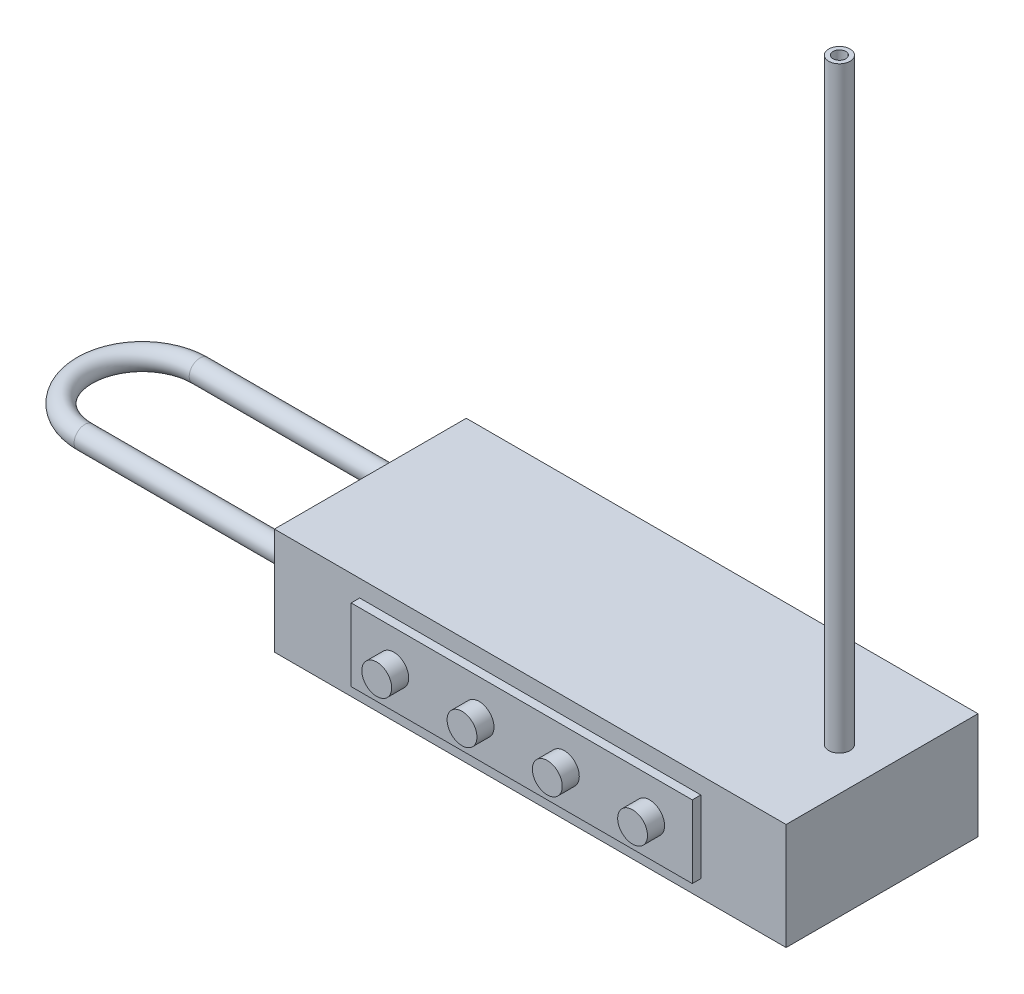
ISO-10303-21;
HEADER;
FILE_DESCRIPTION(('STEP AP214'),'2;1');
FILE_NAME('part.step','',(''),(''),'','','');
FILE_SCHEMA(('AUTOMOTIVE_DESIGN { 1 0 10303 214 1 1 1 1 }'));
ENDSEC;
DATA;
#1=APPLICATION_CONTEXT('core data for automotive mechanical design processes');
#2=APPLICATION_PROTOCOL_DEFINITION('international standard','automotive_design',2000,#1);
#3=PRODUCT_CONTEXT('',#1,'mechanical');
#4=PRODUCT('Part','Part','',(#3));
#5=PRODUCT_RELATED_PRODUCT_CATEGORY('part','',(#4));
#6=PRODUCT_DEFINITION_FORMATION('','',#4);
#7=PRODUCT_DEFINITION_CONTEXT('part definition',#1,'design');
#8=PRODUCT_DEFINITION('design','',#6,#7);
#9=PRODUCT_DEFINITION_SHAPE('','',#8);
#10=(LENGTH_UNIT() NAMED_UNIT(*) SI_UNIT(.MILLI.,.METRE.));
#11=(NAMED_UNIT(*) PLANE_ANGLE_UNIT() SI_UNIT($,.RADIAN.));
#12=(NAMED_UNIT(*) SI_UNIT($,.STERADIAN.) SOLID_ANGLE_UNIT());
#13=UNCERTAINTY_MEASURE_WITH_UNIT(LENGTH_MEASURE(1.E-05),#10,'distance_accuracy_value','');
#14=(GEOMETRIC_REPRESENTATION_CONTEXT(3) GLOBAL_UNCERTAINTY_ASSIGNED_CONTEXT((#13)) GLOBAL_UNIT_ASSIGNED_CONTEXT((#10,
#11,#12)) REPRESENTATION_CONTEXT('',''));
#15=CARTESIAN_POINT('',(0.,0.,0.));
#16=DIRECTION('',(0.,0.,1.));
#17=DIRECTION('',(1.,0.,0.));
#18=AXIS2_PLACEMENT_3D('',#15,#16,#17);
#19=CARTESIAN_POINT('',(-60.,12.5,22.5));
#20=DIRECTION('',(0.,0.,-1.));
#21=DIRECTION('',(-1.,0.,0.));
#22=AXIS2_PLACEMENT_3D('',#19,#20,#21);
#23=PLANE('',#22);
#24=DIRECTION('',(1.,0.,0.));
#25=VECTOR('',#24,1.);
#26=CARTESIAN_POINT('',(-60.,-12.5,22.5));
#27=LINE('',#26,#25);
#28=CARTESIAN_POINT('',(-60.,-12.5,22.5));
#29=VERTEX_POINT('',#28);
#30=CARTESIAN_POINT('',(60.,-12.5,22.5));
#31=VERTEX_POINT('',#30);
#32=EDGE_CURVE('E192',#29,#31,#27,.T.);
#33=ORIENTED_EDGE('',*,*,#32,.T.);
#34=DIRECTION('',(0.,-1.,0.));
#35=VECTOR('',#34,1.);
#36=CARTESIAN_POINT('',(60.,12.5,22.5));
#37=LINE('',#36,#35);
#38=CARTESIAN_POINT('',(60.,12.5,22.5));
#39=VERTEX_POINT('',#38);
#40=EDGE_CURVE('E201',#39,#31,#37,.T.);
#41=ORIENTED_EDGE('',*,*,#40,.F.);
#42=DIRECTION('',(1.,0.,0.));
#43=VECTOR('',#42,1.);
#44=CARTESIAN_POINT('',(-60.,12.5,22.5));
#45=LINE('',#44,#43);
#46=CARTESIAN_POINT('',(-60.,12.5,22.5));
#47=VERTEX_POINT('',#46);
#48=EDGE_CURVE('E198',#47,#39,#45,.T.);
#49=ORIENTED_EDGE('',*,*,#48,.F.);
#50=DIRECTION('',(0.,-1.,0.));
#51=VECTOR('',#50,1.);
#52=CARTESIAN_POINT('',(-60.,12.5,22.5));
#53=LINE('',#52,#51);
#54=EDGE_CURVE('E216',#47,#29,#53,.T.);
#55=ORIENTED_EDGE('',*,*,#54,.T.);
#56=EDGE_LOOP('',(#33,#41,#49,#55));
#57=FACE_BOUND('',#56,.T.);
#58=DIRECTION('',(0.,1.,0.));
#59=VECTOR('',#58,1.);
#60=CARTESIAN_POINT('',(40.,8.5,22.5));
#61=LINE('',#60,#59);
#62=CARTESIAN_POINT('',(40.,-8.5,22.5));
#63=VERTEX_POINT('',#62);
#64=CARTESIAN_POINT('',(40.,8.5,22.5));
#65=VERTEX_POINT('',#64);
#66=EDGE_CURVE('E71',#63,#65,#61,.T.);
#67=ORIENTED_EDGE('',*,*,#66,.F.);
#68=DIRECTION('',(1.,0.,0.));
#69=VECTOR('',#68,1.);
#70=CARTESIAN_POINT('',(-40.,-8.5,22.5));
#71=LINE('',#70,#69);
#72=CARTESIAN_POINT('',(-40.,-8.5,22.5));
#73=VERTEX_POINT('',#72);
#74=EDGE_CURVE('E75',#73,#63,#71,.T.);
#75=ORIENTED_EDGE('',*,*,#74,.F.);
#76=DIRECTION('',(0.,-1.,0.));
#77=VECTOR('',#76,1.);
#78=CARTESIAN_POINT('',(-40.,8.5,22.5));
#79=LINE('',#78,#77);
#80=CARTESIAN_POINT('',(-40.,8.5,22.5));
#81=VERTEX_POINT('',#80);
#82=EDGE_CURVE('E591',#81,#73,#79,.T.);
#83=ORIENTED_EDGE('',*,*,#82,.F.);
#84=DIRECTION('',(-1.,0.,0.));
#85=VECTOR('',#84,1.);
#86=CARTESIAN_POINT('',(-40.,8.5,22.5));
#87=LINE('',#86,#85);
#88=EDGE_CURVE('E588',#65,#81,#87,.T.);
#89=ORIENTED_EDGE('',*,*,#88,.F.);
#90=EDGE_LOOP('',(#67,#75,#83,#89));
#91=FACE_BOUND('',#90,.T.);
#92=ADVANCED_FACE('F54',(#57,#91),#23,.F.);
#93=CARTESIAN_POINT('',(60.,12.5,-22.5));
#94=DIRECTION('',(-1.,0.,0.));
#95=DIRECTION('',(0.,0.,1.));
#96=AXIS2_PLACEMENT_3D('',#93,#94,#95);
#97=PLANE('',#96);
#98=DIRECTION('',(0.,0.,-1.));
#99=VECTOR('',#98,1.);
#100=CARTESIAN_POINT('',(60.,-12.5,-22.5));
#101=LINE('',#100,#99);
#102=CARTESIAN_POINT('',(60.,-12.5,-22.5));
#103=VERTEX_POINT('',#102);
#104=EDGE_CURVE('E183',#31,#103,#101,.T.);
#105=ORIENTED_EDGE('',*,*,#104,.T.);
#106=DIRECTION('',(0.,-1.,0.));
#107=VECTOR('',#106,1.);
#108=CARTESIAN_POINT('',(60.,12.5,-22.5));
#109=LINE('',#108,#107);
#110=CARTESIAN_POINT('',(60.,12.5,-22.5));
#111=VERTEX_POINT('',#110);
#112=EDGE_CURVE('E224',#111,#103,#109,.T.);
#113=ORIENTED_EDGE('',*,*,#112,.F.);
#114=DIRECTION('',(0.,0.,-1.));
#115=VECTOR('',#114,1.);
#116=CARTESIAN_POINT('',(60.,12.5,-22.5));
#117=LINE('',#116,#115);
#118=EDGE_CURVE('E187',#39,#111,#117,.T.);
#119=ORIENTED_EDGE('',*,*,#118,.F.);
#120=ORIENTED_EDGE('',*,*,#40,.T.);
#121=EDGE_LOOP('',(#105,#113,#119,#120));
#122=FACE_BOUND('',#121,.T.);
#123=ADVANCED_FACE('F56',(#122),#97,.F.);
#124=CARTESIAN_POINT('',(-60.,12.5,-22.5));
#125=DIRECTION('',(0.,0.,1.));
#126=DIRECTION('',(1.,0.,0.));
#127=AXIS2_PLACEMENT_3D('',#124,#125,#126);
#128=PLANE('',#127);
#129=DIRECTION('',(-1.,0.,0.));
#130=VECTOR('',#129,1.);
#131=CARTESIAN_POINT('',(-60.,-12.5,-22.5));
#132=LINE('',#131,#130);
#133=CARTESIAN_POINT('',(-60.,-12.5,-22.5));
#134=VERTEX_POINT('',#133);
#135=EDGE_CURVE('E205',#103,#134,#132,.T.);
#136=ORIENTED_EDGE('',*,*,#135,.T.);
#137=DIRECTION('',(0.,-1.,0.));
#138=VECTOR('',#137,1.);
#139=CARTESIAN_POINT('',(-60.,12.5,-22.5));
#140=LINE('',#139,#138);
#141=CARTESIAN_POINT('',(-60.,12.5,-22.5));
#142=VERTEX_POINT('',#141);
#143=EDGE_CURVE('E220',#142,#134,#140,.T.);
#144=ORIENTED_EDGE('',*,*,#143,.F.);
#145=DIRECTION('',(-1.,0.,0.));
#146=VECTOR('',#145,1.);
#147=CARTESIAN_POINT('',(-60.,12.5,-22.5));
#148=LINE('',#147,#146);
#149=EDGE_CURVE('E191',#111,#142,#148,.T.);
#150=ORIENTED_EDGE('',*,*,#149,.F.);
#151=ORIENTED_EDGE('',*,*,#112,.T.);
#152=EDGE_LOOP('',(#136,#144,#150,#151));
#153=FACE_BOUND('',#152,.T.);
#154=ADVANCED_FACE('F255',(#153),#128,.F.);
#155=CARTESIAN_POINT('',(-60.,12.5,-22.5));
#156=DIRECTION('',(1.,0.,0.));
#157=DIRECTION('',(0.,0.,-1.));
#158=AXIS2_PLACEMENT_3D('',#155,#156,#157);
#159=PLANE('',#158);
#160=CARTESIAN_POINT('',(-60.,0.,13.5));
#161=DIRECTION('',(-1.,0.,0.));
#162=DIRECTION('',(0.,0.,1.));
#163=AXIS2_PLACEMENT_3D('',#160,#161,#162);
#164=CIRCLE('',#163,2.5);
#165=CARTESIAN_POINT('',(-60.,0.,16.));
#166=VERTEX_POINT('',#165);
#167=EDGE_CURVE('E158',#166,#166,#164,.T.);
#168=ORIENTED_EDGE('',*,*,#167,.F.);
#169=EDGE_LOOP('',(#168));
#170=FACE_BOUND('',#169,.T.);
#171=CARTESIAN_POINT('',(-60.,0.,-13.5));
#172=DIRECTION('',(1.,0.,0.));
#173=DIRECTION('',(0.,0.,-1.));
#174=AXIS2_PLACEMENT_3D('',#171,#172,#173);
#175=CIRCLE('',#174,2.5);
#176=CARTESIAN_POINT('',(-60.,0.,-16.));
#177=VERTEX_POINT('',#176);
#178=EDGE_CURVE('E170',#177,#177,#175,.T.);
#179=ORIENTED_EDGE('',*,*,#178,.T.);
#180=EDGE_LOOP('',(#179));
#181=FACE_BOUND('',#180,.T.);
#182=DIRECTION('',(0.,0.,1.));
#183=VECTOR('',#182,1.);
#184=CARTESIAN_POINT('',(-60.,-12.5,-22.5));
#185=LINE('',#184,#183);
#186=EDGE_CURVE('E208',#134,#29,#185,.T.);
#187=ORIENTED_EDGE('',*,*,#186,.T.);
#188=ORIENTED_EDGE('',*,*,#54,.F.);
#189=DIRECTION('',(0.,0.,1.));
#190=VECTOR('',#189,1.);
#191=CARTESIAN_POINT('',(-60.,12.5,-22.5));
#192=LINE('',#191,#190);
#193=EDGE_CURVE('E195',#142,#47,#192,.T.);
#194=ORIENTED_EDGE('',*,*,#193,.F.);
#195=ORIENTED_EDGE('',*,*,#143,.T.);
#196=EDGE_LOOP('',(#187,#188,#194,#195));
#197=FACE_BOUND('',#196,.T.);
#198=ADVANCED_FACE('F242',(#170,#181,#197),#159,.F.);
#199=CARTESIAN_POINT('',(0.,12.5,0.));
#200=DIRECTION('',(0.,1.,0.));
#201=DIRECTION('',(0.,0.,1.));
#202=AXIS2_PLACEMENT_3D('',#199,#200,#201);
#203=PLANE('',#202);
#204=CARTESIAN_POINT('',(50.,12.5,0.));
#205=DIRECTION('',(0.,1.,0.));
#206=DIRECTION('',(0.,0.,1.));
#207=AXIS2_PLACEMENT_3D('',#204,#205,#206);
#208=CIRCLE('',#207,2.5);
#209=CARTESIAN_POINT('',(50.,12.5,2.5));
#210=VERTEX_POINT('',#209);
#211=EDGE_CURVE('E178',#210,#210,#208,.T.);
#212=ORIENTED_EDGE('',*,*,#211,.F.);
#213=EDGE_LOOP('',(#212));
#214=FACE_BOUND('',#213,.T.);
#215=ORIENTED_EDGE('',*,*,#118,.T.);
#216=ORIENTED_EDGE('',*,*,#149,.T.);
#217=ORIENTED_EDGE('',*,*,#193,.T.);
#218=ORIENTED_EDGE('',*,*,#48,.T.);
#219=EDGE_LOOP('',(#215,#216,#217,#218));
#220=FACE_BOUND('',#219,.T.);
#221=ADVANCED_FACE('F254',(#214,#220),#203,.T.);
#222=CARTESIAN_POINT('',(0.,-12.5,0.));
#223=DIRECTION('',(0.,1.,0.));
#224=DIRECTION('',(0.,0.,1.));
#225=AXIS2_PLACEMENT_3D('',#222,#223,#224);
#226=PLANE('',#225);
#227=ORIENTED_EDGE('',*,*,#104,.F.);
#228=ORIENTED_EDGE('',*,*,#32,.F.);
#229=ORIENTED_EDGE('',*,*,#186,.F.);
#230=ORIENTED_EDGE('',*,*,#135,.F.);
#231=EDGE_LOOP('',(#227,#228,#229,#230));
#232=FACE_BOUND('',#231,.T.);
#233=ADVANCED_FACE('F291',(#232),#226,.F.);
#234=CARTESIAN_POINT('',(50.,152.5,0.));
#235=DIRECTION('',(0.,1.,0.));
#236=DIRECTION('',(0.,0.,1.));
#237=AXIS2_PLACEMENT_3D('',#234,#235,#236);
#238=PLANE('',#237);
#239=CARTESIAN_POINT('',(50.,152.5,0.));
#240=DIRECTION('',(0.,1.,0.));
#241=DIRECTION('',(0.,0.,1.));
#242=AXIS2_PLACEMENT_3D('',#239,#240,#241);
#243=CIRCLE('',#242,2.5);
#244=CARTESIAN_POINT('',(50.,152.5,2.5));
#245=VERTEX_POINT('',#244);
#246=EDGE_CURVE('E179',#245,#245,#243,.T.);
#247=ORIENTED_EDGE('',*,*,#246,.T.);
#248=EDGE_LOOP('',(#247));
#249=FACE_BOUND('',#248,.T.);
#250=CARTESIAN_POINT('',(50.,152.5,0.));
#251=DIRECTION('',(0.,1.,0.));
#252=DIRECTION('',(0.,0.,1.));
#253=AXIS2_PLACEMENT_3D('',#250,#251,#252);
#254=CIRCLE('',#253,1.5);
#255=CARTESIAN_POINT('',(50.,152.5,1.5));
#256=VERTEX_POINT('',#255);
#257=EDGE_CURVE('E174',#256,#256,#254,.T.);
#258=ORIENTED_EDGE('',*,*,#257,.F.);
#259=EDGE_LOOP('',(#258));
#260=FACE_BOUND('',#259,.T.);
#261=ADVANCED_FACE('F288',(#249,#260),#238,.T.);
#262=CARTESIAN_POINT('',(50.,152.5,0.));
#263=DIRECTION('',(0.,-1.,0.));
#264=DIRECTION('',(0.,0.,-1.));
#265=AXIS2_PLACEMENT_3D('',#262,#263,#264);
#266=CYLINDRICAL_SURFACE('',#265,2.5);
#267=ORIENTED_EDGE('',*,*,#246,.F.);
#268=EDGE_LOOP('',(#267));
#269=FACE_BOUND('',#268,.T.);
#270=ORIENTED_EDGE('',*,*,#211,.T.);
#271=EDGE_LOOP('',(#270));
#272=FACE_BOUND('',#271,.T.);
#273=ADVANCED_FACE('F286',(#269,#272),#266,.T.);
#274=CARTESIAN_POINT('',(50.,152.5,0.));
#275=DIRECTION('',(0.,-1.,0.));
#276=DIRECTION('',(0.,0.,-1.));
#277=AXIS2_PLACEMENT_3D('',#274,#275,#276);
#278=CYLINDRICAL_SURFACE('',#277,1.5);
#279=ORIENTED_EDGE('',*,*,#257,.T.);
#280=EDGE_LOOP('',(#279));
#281=FACE_BOUND('',#280,.T.);
#282=CARTESIAN_POINT('',(50.,12.5,0.));
#283=DIRECTION('',(0.,1.,0.));
#284=DIRECTION('',(0.,0.,1.));
#285=AXIS2_PLACEMENT_3D('',#282,#283,#284);
#286=CIRCLE('',#285,1.5);
#287=CARTESIAN_POINT('',(50.,12.5,1.5));
#288=VERTEX_POINT('',#287);
#289=EDGE_CURVE('E228',#288,#288,#286,.F.);
#290=ORIENTED_EDGE('',*,*,#289,.T.);
#291=EDGE_LOOP('',(#290));
#292=FACE_BOUND('',#291,.T.);
#293=ADVANCED_FACE('F283',(#281,#292),#278,.F.);
#294=ORIENTED_EDGE('',*,*,#289,.F.);
#295=EDGE_LOOP('',(#294));
#296=FACE_BOUND('',#295,.T.);
#297=ADVANCED_FACE('F274',(#296),#203,.T.);
#298=CARTESIAN_POINT('',(-60.,0.,13.5));
#299=DIRECTION('',(-1.,0.,0.));
#300=DIRECTION('',(0.,0.,1.));
#301=AXIS2_PLACEMENT_3D('',#298,#299,#300);
#302=CYLINDRICAL_SURFACE('',#301,2.5);
#303=CARTESIAN_POINT('',(-113.472065940954,0.,13.5));
#304=DIRECTION('',(-1.,0.,0.));
#305=DIRECTION('',(0.,0.,1.));
#306=AXIS2_PLACEMENT_3D('',#303,#304,#305);
#307=CIRCLE('',#306,2.5);
#308=CARTESIAN_POINT('',(-113.472065940954,0.,16.));
#309=VERTEX_POINT('',#308);
#310=EDGE_CURVE('E162',#309,#309,#307,.T.);
#311=ORIENTED_EDGE('',*,*,#310,.F.);
#312=EDGE_LOOP('',(#311));
#313=FACE_BOUND('',#312,.T.);
#314=ORIENTED_EDGE('',*,*,#167,.T.);
#315=EDGE_LOOP('',(#314));
#316=FACE_BOUND('',#315,.T.);
#317=ADVANCED_FACE('F270',(#313,#316),#302,.T.);
#318=CARTESIAN_POINT('',(-113.472065940954,0.,0.));
#319=DIRECTION('',(0.,-1.,0.));
#320=DIRECTION('',(0.,0.,-1.));
#321=AXIS2_PLACEMENT_3D('',#318,#319,#320);
#322=TOROIDAL_SURFACE('',#321,13.5,2.5);
#323=CARTESIAN_POINT('',(-113.472065940954,0.,-13.5));
#324=DIRECTION('',(1.,0.,0.));
#325=DIRECTION('',(0.,0.,-1.));
#326=AXIS2_PLACEMENT_3D('',#323,#324,#325);
#327=CIRCLE('',#326,2.5);
#328=CARTESIAN_POINT('',(-113.472065940954,0.,-16.));
#329=VERTEX_POINT('',#328);
#330=EDGE_CURVE('E166',#329,#329,#327,.T.);
#331=CARTESIAN_POINT('',(-113.472065940954,0.,0.));
#332=DIRECTION('',(0.,-1.,0.));
#333=DIRECTION('',(0.,0.,-1.));
#334=AXIS2_PLACEMENT_3D('',#331,#332,#333);
#335=CIRCLE('',#334,16.);
#336=EDGE_CURVE('',#309,#329,#335,.T.);
#337=ORIENTED_EDGE('',*,*,#310,.T.);
#338=ORIENTED_EDGE('',*,*,#330,.F.);
#339=ORIENTED_EDGE('',*,*,#336,.T.);
#340=ORIENTED_EDGE('',*,*,#336,.F.);
#341=EDGE_LOOP('',(#337,#339,#338,#340));
#342=FACE_BOUND('',#341,.T.);
#343=ADVANCED_FACE('F273',(#342),#322,.T.);
#344=CARTESIAN_POINT('',(-113.472065940954,0.,-13.5));
#345=DIRECTION('',(1.,0.,0.));
#346=DIRECTION('',(0.,0.,-1.));
#347=AXIS2_PLACEMENT_3D('',#344,#345,#346);
#348=CYLINDRICAL_SURFACE('',#347,2.5);
#349=ORIENTED_EDGE('',*,*,#178,.F.);
#350=EDGE_LOOP('',(#349));
#351=FACE_BOUND('',#350,.T.);
#352=ORIENTED_EDGE('',*,*,#330,.T.);
#353=EDGE_LOOP('',(#352));
#354=FACE_BOUND('',#353,.T.);
#355=ADVANCED_FACE('F278',(#351,#354),#348,.T.);
#356=CARTESIAN_POINT('',(40.,8.5,24.5));
#357=DIRECTION('',(-1.,0.,0.));
#358=DIRECTION('',(0.,0.,1.));
#359=AXIS2_PLACEMENT_3D('',#356,#357,#358);
#360=PLANE('',#359);
#361=ORIENTED_EDGE('',*,*,#66,.T.);
#362=DIRECTION('',(0.,0.,-1.));
#363=VECTOR('',#362,1.);
#364=CARTESIAN_POINT('',(40.,8.5,24.5));
#365=LINE('',#364,#363);
#366=CARTESIAN_POINT('',(40.,8.5,24.5));
#367=VERTEX_POINT('',#366);
#368=EDGE_CURVE('E124',#367,#65,#365,.T.);
#369=ORIENTED_EDGE('',*,*,#368,.F.);
#370=DIRECTION('',(0.,1.,0.));
#371=VECTOR('',#370,1.);
#372=CARTESIAN_POINT('',(40.,8.5,24.5));
#373=LINE('',#372,#371);
#374=CARTESIAN_POINT('',(40.,-8.5,24.5));
#375=VERTEX_POINT('',#374);
#376=EDGE_CURVE('E131',#375,#367,#373,.T.);
#377=ORIENTED_EDGE('',*,*,#376,.F.);
#378=DIRECTION('',(0.,0.,-1.));
#379=VECTOR('',#378,1.);
#380=CARTESIAN_POINT('',(40.,-8.5,24.5));
#381=LINE('',#380,#379);
#382=EDGE_CURVE('E585',#375,#63,#381,.T.);
#383=ORIENTED_EDGE('',*,*,#382,.T.);
#384=EDGE_LOOP('',(#361,#369,#377,#383));
#385=FACE_BOUND('',#384,.T.);
#386=ADVANCED_FACE('F142',(#385),#360,.F.);
#387=CARTESIAN_POINT('',(-40.,8.5,24.5));
#388=DIRECTION('',(0.,-1.,0.));
#389=DIRECTION('',(0.,0.,-1.));
#390=AXIS2_PLACEMENT_3D('',#387,#388,#389);
#391=PLANE('',#390);
#392=ORIENTED_EDGE('',*,*,#88,.T.);
#393=DIRECTION('',(0.,0.,-1.));
#394=VECTOR('',#393,1.);
#395=CARTESIAN_POINT('',(-40.,8.5,24.5));
#396=LINE('',#395,#394);
#397=CARTESIAN_POINT('',(-40.,8.5,24.5));
#398=VERTEX_POINT('',#397);
#399=EDGE_CURVE('E126',#398,#81,#396,.T.);
#400=ORIENTED_EDGE('',*,*,#399,.F.);
#401=DIRECTION('',(-1.,0.,0.));
#402=VECTOR('',#401,1.);
#403=CARTESIAN_POINT('',(-40.,8.5,24.5));
#404=LINE('',#403,#402);
#405=EDGE_CURVE('E119',#367,#398,#404,.T.);
#406=ORIENTED_EDGE('',*,*,#405,.F.);
#407=ORIENTED_EDGE('',*,*,#368,.T.);
#408=EDGE_LOOP('',(#392,#400,#406,#407));
#409=FACE_BOUND('',#408,.T.);
#410=ADVANCED_FACE('F122',(#409),#391,.F.);
#411=CARTESIAN_POINT('',(-40.,8.5,24.5));
#412=DIRECTION('',(1.,0.,0.));
#413=DIRECTION('',(0.,0.,-1.));
#414=AXIS2_PLACEMENT_3D('',#411,#412,#413);
#415=PLANE('',#414);
#416=ORIENTED_EDGE('',*,*,#82,.T.);
#417=DIRECTION('',(0.,0.,-1.));
#418=VECTOR('',#417,1.);
#419=CARTESIAN_POINT('',(-40.,-8.5,24.5));
#420=LINE('',#419,#418);
#421=CARTESIAN_POINT('',(-40.,-8.5,24.5));
#422=VERTEX_POINT('',#421);
#423=EDGE_CURVE('E151',#422,#73,#420,.T.);
#424=ORIENTED_EDGE('',*,*,#423,.F.);
#425=DIRECTION('',(0.,-1.,0.));
#426=VECTOR('',#425,1.);
#427=CARTESIAN_POINT('',(-40.,8.5,24.5));
#428=LINE('',#427,#426);
#429=EDGE_CURVE('E130',#398,#422,#428,.T.);
#430=ORIENTED_EDGE('',*,*,#429,.F.);
#431=ORIENTED_EDGE('',*,*,#399,.T.);
#432=EDGE_LOOP('',(#416,#424,#430,#431));
#433=FACE_BOUND('',#432,.T.);
#434=ADVANCED_FACE('F378',(#433),#415,.F.);
#435=CARTESIAN_POINT('',(-40.,-8.5,24.5));
#436=DIRECTION('',(0.,1.,0.));
#437=DIRECTION('',(0.,0.,1.));
#438=AXIS2_PLACEMENT_3D('',#435,#436,#437);
#439=PLANE('',#438);
#440=ORIENTED_EDGE('',*,*,#74,.T.);
#441=ORIENTED_EDGE('',*,*,#382,.F.);
#442=DIRECTION('',(1.,0.,0.));
#443=VECTOR('',#442,1.);
#444=CARTESIAN_POINT('',(-40.,-8.5,24.5));
#445=LINE('',#444,#443);
#446=EDGE_CURVE('E136',#422,#375,#445,.T.);
#447=ORIENTED_EDGE('',*,*,#446,.F.);
#448=ORIENTED_EDGE('',*,*,#423,.T.);
#449=EDGE_LOOP('',(#440,#441,#447,#448));
#450=FACE_BOUND('',#449,.T.);
#451=ADVANCED_FACE('F384',(#450),#439,.F.);
#452=CARTESIAN_POINT('',(0.,0.,24.5));
#453=DIRECTION('',(0.,0.,1.));
#454=DIRECTION('',(1.,0.,0.));
#455=AXIS2_PLACEMENT_3D('',#452,#453,#454);
#456=PLANE('',#455);
#457=CARTESIAN_POINT('',(30.,0.,24.5));
#458=DIRECTION('',(0.,0.,1.));
#459=DIRECTION('',(1.,0.,0.));
#460=AXIS2_PLACEMENT_3D('',#457,#458,#459);
#461=CIRCLE('',#460,3.5);
#462=CARTESIAN_POINT('',(33.5,0.,24.5));
#463=VERTEX_POINT('',#462);
#464=EDGE_CURVE('E552',#463,#463,#461,.T.);
#465=ORIENTED_EDGE('',*,*,#464,.F.);
#466=EDGE_LOOP('',(#465));
#467=FACE_BOUND('',#466,.T.);
#468=CARTESIAN_POINT('',(10.,0.,24.5));
#469=DIRECTION('',(0.,0.,1.));
#470=DIRECTION('',(1.,0.,0.));
#471=AXIS2_PLACEMENT_3D('',#468,#469,#470);
#472=CIRCLE('',#471,3.5);
#473=CARTESIAN_POINT('',(13.5,0.,24.5));
#474=VERTEX_POINT('',#473);
#475=EDGE_CURVE('E551',#474,#474,#472,.T.);
#476=ORIENTED_EDGE('',*,*,#475,.F.);
#477=EDGE_LOOP('',(#476));
#478=FACE_BOUND('',#477,.T.);
#479=CARTESIAN_POINT('',(-30.,0.,24.5));
#480=DIRECTION('',(0.,0.,1.));
#481=DIRECTION('',(1.,0.,0.));
#482=AXIS2_PLACEMENT_3D('',#479,#480,#481);
#483=CIRCLE('',#482,3.5);
#484=CARTESIAN_POINT('',(-26.5,0.,24.5));
#485=VERTEX_POINT('',#484);
#486=EDGE_CURVE('E565',#485,#485,#483,.T.);
#487=ORIENTED_EDGE('',*,*,#486,.F.);
#488=EDGE_LOOP('',(#487));
#489=FACE_BOUND('',#488,.T.);
#490=CARTESIAN_POINT('',(-10.,0.,24.5));
#491=DIRECTION('',(0.,0.,1.));
#492=DIRECTION('',(1.,0.,0.));
#493=AXIS2_PLACEMENT_3D('',#490,#491,#492);
#494=CIRCLE('',#493,3.5);
#495=CARTESIAN_POINT('',(-6.5,0.,24.5));
#496=VERTEX_POINT('',#495);
#497=EDGE_CURVE('E573',#496,#496,#494,.T.);
#498=ORIENTED_EDGE('',*,*,#497,.F.);
#499=EDGE_LOOP('',(#498));
#500=FACE_BOUND('',#499,.T.);
#501=ORIENTED_EDGE('',*,*,#376,.T.);
#502=ORIENTED_EDGE('',*,*,#405,.T.);
#503=ORIENTED_EDGE('',*,*,#429,.T.);
#504=ORIENTED_EDGE('',*,*,#446,.T.);
#505=EDGE_LOOP('',(#501,#502,#503,#504));
#506=FACE_BOUND('',#505,.T.);
#507=ADVANCED_FACE('F134',(#467,#478,#489,#500,#506),#456,.T.);
#508=CARTESIAN_POINT('',(-10.,0.,28.5));
#509=DIRECTION('',(0.,0.,-1.));
#510=DIRECTION('',(-1.,0.,0.));
#511=AXIS2_PLACEMENT_3D('',#508,#509,#510);
#512=CYLINDRICAL_SURFACE('',#511,3.5);
#513=CARTESIAN_POINT('',(-10.,0.,28.5));
#514=DIRECTION('',(0.,0.,1.));
#515=DIRECTION('',(1.,0.,0.));
#516=AXIS2_PLACEMENT_3D('',#513,#514,#515);
#517=CIRCLE('',#516,3.5);
#518=CARTESIAN_POINT('',(-6.5,0.,28.5));
#519=VERTEX_POINT('',#518);
#520=EDGE_CURVE('E574',#519,#519,#517,.T.);
#521=ORIENTED_EDGE('',*,*,#520,.F.);
#522=EDGE_LOOP('',(#521));
#523=FACE_BOUND('',#522,.T.);
#524=ORIENTED_EDGE('',*,*,#497,.T.);
#525=EDGE_LOOP('',(#524));
#526=FACE_BOUND('',#525,.T.);
#527=ADVANCED_FACE('F400',(#523,#526),#512,.T.);
#528=CARTESIAN_POINT('',(-10.,0.,28.5));
#529=DIRECTION('',(0.,0.,1.));
#530=DIRECTION('',(1.,0.,0.));
#531=AXIS2_PLACEMENT_3D('',#528,#529,#530);
#532=PLANE('',#531);
#533=ORIENTED_EDGE('',*,*,#520,.T.);
#534=EDGE_LOOP('',(#533));
#535=FACE_BOUND('',#534,.T.);
#536=ADVANCED_FACE('F409',(#535),#532,.T.);
#537=CARTESIAN_POINT('',(-30.,0.,28.5));
#538=DIRECTION('',(0.,0.,-1.));
#539=DIRECTION('',(-1.,0.,0.));
#540=AXIS2_PLACEMENT_3D('',#537,#538,#539);
#541=CYLINDRICAL_SURFACE('',#540,3.5);
#542=CARTESIAN_POINT('',(-30.,0.,28.5));
#543=DIRECTION('',(0.,0.,1.));
#544=DIRECTION('',(1.,0.,0.));
#545=AXIS2_PLACEMENT_3D('',#542,#543,#544);
#546=CIRCLE('',#545,3.5);
#547=CARTESIAN_POINT('',(-26.5,0.,28.5));
#548=VERTEX_POINT('',#547);
#549=EDGE_CURVE('E569',#548,#548,#546,.T.);
#550=ORIENTED_EDGE('',*,*,#549,.F.);
#551=EDGE_LOOP('',(#550));
#552=FACE_BOUND('',#551,.T.);
#553=ORIENTED_EDGE('',*,*,#486,.T.);
#554=EDGE_LOOP('',(#553));
#555=FACE_BOUND('',#554,.T.);
#556=ADVANCED_FACE('F416',(#552,#555),#541,.T.);
#557=CARTESIAN_POINT('',(-30.,0.,28.5));
#558=DIRECTION('',(0.,0.,1.));
#559=DIRECTION('',(1.,0.,0.));
#560=AXIS2_PLACEMENT_3D('',#557,#558,#559);
#561=PLANE('',#560);
#562=ORIENTED_EDGE('',*,*,#549,.T.);
#563=EDGE_LOOP('',(#562));
#564=FACE_BOUND('',#563,.T.);
#565=ADVANCED_FACE('F423',(#564),#561,.T.);
#566=CARTESIAN_POINT('',(10.,0.,28.5));
#567=DIRECTION('',(0.,0.,-1.));
#568=DIRECTION('',(-1.,0.,0.));
#569=AXIS2_PLACEMENT_3D('',#566,#567,#568);
#570=CYLINDRICAL_SURFACE('',#569,3.5);
#571=CARTESIAN_POINT('',(10.,0.,28.5));
#572=DIRECTION('',(0.,0.,1.));
#573=DIRECTION('',(1.,0.,0.));
#574=AXIS2_PLACEMENT_3D('',#571,#572,#573);
#575=CIRCLE('',#574,3.5);
#576=CARTESIAN_POINT('',(13.5,0.,28.5));
#577=VERTEX_POINT('',#576);
#578=EDGE_CURVE('E557',#577,#577,#575,.T.);
#579=ORIENTED_EDGE('',*,*,#578,.F.);
#580=EDGE_LOOP('',(#579));
#581=FACE_BOUND('',#580,.T.);
#582=ORIENTED_EDGE('',*,*,#475,.T.);
#583=EDGE_LOOP('',(#582));
#584=FACE_BOUND('',#583,.T.);
#585=ADVANCED_FACE('F431',(#581,#584),#570,.T.);
#586=CARTESIAN_POINT('',(10.,0.,28.5));
#587=DIRECTION('',(0.,0.,1.));
#588=DIRECTION('',(1.,0.,0.));
#589=AXIS2_PLACEMENT_3D('',#586,#587,#588);
#590=PLANE('',#589);
#591=ORIENTED_EDGE('',*,*,#578,.T.);
#592=EDGE_LOOP('',(#591));
#593=FACE_BOUND('',#592,.T.);
#594=ADVANCED_FACE('F439',(#593),#590,.T.);
#595=CARTESIAN_POINT('',(30.,0.,28.5));
#596=DIRECTION('',(0.,0.,-1.));
#597=DIRECTION('',(-1.,0.,0.));
#598=AXIS2_PLACEMENT_3D('',#595,#596,#597);
#599=CYLINDRICAL_SURFACE('',#598,3.5);
#600=CARTESIAN_POINT('',(30.,0.,28.5));
#601=DIRECTION('',(0.,0.,1.));
#602=DIRECTION('',(1.,0.,0.));
#603=AXIS2_PLACEMENT_3D('',#600,#601,#602);
#604=CIRCLE('',#603,3.5);
#605=CARTESIAN_POINT('',(33.5,0.,28.5));
#606=VERTEX_POINT('',#605);
#607=EDGE_CURVE('E549',#606,#606,#604,.T.);
#608=ORIENTED_EDGE('',*,*,#607,.F.);
#609=EDGE_LOOP('',(#608));
#610=FACE_BOUND('',#609,.T.);
#611=ORIENTED_EDGE('',*,*,#464,.T.);
#612=EDGE_LOOP('',(#611));
#613=FACE_BOUND('',#612,.T.);
#614=ADVANCED_FACE('F447',(#610,#613),#599,.T.);
#615=CARTESIAN_POINT('',(30.,0.,28.5));
#616=DIRECTION('',(0.,0.,1.));
#617=DIRECTION('',(1.,0.,0.));
#618=AXIS2_PLACEMENT_3D('',#615,#616,#617);
#619=PLANE('',#618);
#620=ORIENTED_EDGE('',*,*,#607,.T.);
#621=EDGE_LOOP('',(#620));
#622=FACE_BOUND('',#621,.T.);
#623=ADVANCED_FACE('F454',(#622),#619,.T.);
#624=CLOSED_SHELL('',(#92,#123,#154,#198,#221,#233,#261,#273,#293,#297,#317,#343,#355,#386,#410,
#434,#451,#507,#527,#536,#556,#565,#585,#594,#614,#623));
#625=CARTESIAN_POINT('',(-60.,0.,13.5));
#626=DIRECTION('',(-1.,0.,0.));
#627=DIRECTION('',(0.,0.,1.));
#628=AXIS2_PLACEMENT_3D('',#625,#626,#627);
#629=CYLINDRICAL_SURFACE('',#628,1.5);
#630=CARTESIAN_POINT('',(-113.472065940954,0.,13.5));
#631=DIRECTION('',(1.,0.,0.));
#632=DIRECTION('',(0.,0.,-1.));
#633=AXIS2_PLACEMENT_3D('',#630,#631,#632);
#634=CIRCLE('',#633,1.5);
#635=CARTESIAN_POINT('',(-113.472065940954,0.,15.));
#636=VERTEX_POINT('',#635);
#637=EDGE_CURVE('E144',#636,#636,#634,.F.);
#638=ORIENTED_EDGE('',*,*,#637,.T.);
#639=EDGE_LOOP('',(#638));
#640=FACE_BOUND('',#639,.T.);
#641=CARTESIAN_POINT('',(-60.,0.,13.5));
#642=DIRECTION('',(1.,0.,0.));
#643=DIRECTION('',(0.,0.,-1.));
#644=AXIS2_PLACEMENT_3D('',#641,#642,#643);
#645=CIRCLE('',#644,1.5);
#646=CARTESIAN_POINT('',(-60.,0.,12.));
#647=VERTEX_POINT('',#646);
#648=EDGE_CURVE('E12',#647,#647,#645,.T.);
#649=ORIENTED_EDGE('',*,*,#648,.T.);
#650=EDGE_LOOP('',(#649));
#651=FACE_BOUND('',#650,.T.);
#652=ADVANCED_FACE('F251',(#640,#651),#629,.F.);
#653=CARTESIAN_POINT('',(-113.472065940954,0.,0.));
#654=DIRECTION('',(0.,-1.,0.));
#655=DIRECTION('',(0.,0.,-1.));
#656=AXIS2_PLACEMENT_3D('',#653,#654,#655);
#657=TOROIDAL_SURFACE('',#656,13.5,1.5);
#658=CARTESIAN_POINT('',(-113.472065940954,0.,-13.5));
#659=DIRECTION('',(1.,0.,0.));
#660=DIRECTION('',(0.,0.,-1.));
#661=AXIS2_PLACEMENT_3D('',#658,#659,#660);
#662=CIRCLE('',#661,1.5);
#663=CARTESIAN_POINT('',(-113.472065940954,0.,-15.));
#664=VERTEX_POINT('',#663);
#665=EDGE_CURVE('E149',#664,#664,#662,.T.);
#666=CARTESIAN_POINT('',(-113.472065940954,0.,0.));
#667=DIRECTION('',(0.,-1.,0.));
#668=DIRECTION('',(0.,0.,-1.));
#669=AXIS2_PLACEMENT_3D('',#666,#667,#668);
#670=CIRCLE('',#669,15.);
#671=EDGE_CURVE('',#636,#664,#670,.T.);
#672=ORIENTED_EDGE('',*,*,#637,.F.);
#673=ORIENTED_EDGE('',*,*,#665,.T.);
#674=ORIENTED_EDGE('',*,*,#671,.T.);
#675=ORIENTED_EDGE('',*,*,#671,.F.);
#676=EDGE_LOOP('',(#672,#674,#673,#675));
#677=FACE_BOUND('',#676,.T.);
#678=ADVANCED_FACE('F249',(#677),#657,.F.);
#679=CARTESIAN_POINT('',(-113.472065940954,0.,-13.5));
#680=DIRECTION('',(1.,0.,0.));
#681=DIRECTION('',(0.,0.,-1.));
#682=AXIS2_PLACEMENT_3D('',#679,#680,#681);
#683=CYLINDRICAL_SURFACE('',#682,1.5);
#684=CARTESIAN_POINT('',(-60.,0.,-13.5));
#685=DIRECTION('',(1.,0.,0.));
#686=DIRECTION('',(0.,0.,-1.));
#687=AXIS2_PLACEMENT_3D('',#684,#685,#686);
#688=CIRCLE('',#687,1.5);
#689=CARTESIAN_POINT('',(-60.,0.,-15.));
#690=VERTEX_POINT('',#689);
#691=EDGE_CURVE('E64',#690,#690,#688,.T.);
#692=ORIENTED_EDGE('',*,*,#691,.T.);
#693=EDGE_LOOP('',(#692));
#694=FACE_BOUND('',#693,.T.);
#695=ORIENTED_EDGE('',*,*,#665,.F.);
#696=EDGE_LOOP('',(#695));
#697=FACE_BOUND('',#696,.T.);
#698=ADVANCED_FACE('F235',(#694,#697),#683,.F.);
#699=ORIENTED_EDGE('',*,*,#691,.F.);
#700=EDGE_LOOP('',(#699));
#701=FACE_BOUND('',#700,.T.);
#702=ADVANCED_FACE('F238',(#701),#159,.F.);
#703=ORIENTED_EDGE('',*,*,#648,.F.);
#704=EDGE_LOOP('',(#703));
#705=FACE_BOUND('',#704,.T.);
#706=ADVANCED_FACE('F240',(#705),#159,.F.);
#707=CLOSED_SHELL('',(#652,#678,#698,#702,#706));
#708=ORIENTED_CLOSED_SHELL('',*,#707,.T.);
#709=BREP_WITH_VOIDS('B2',#624,(#708));
#710=ADVANCED_BREP_SHAPE_REPRESENTATION('',(#18,#709),#14);
#711=SHAPE_DEFINITION_REPRESENTATION(#9,#710);
ENDSEC;
END-ISO-10303-21;
